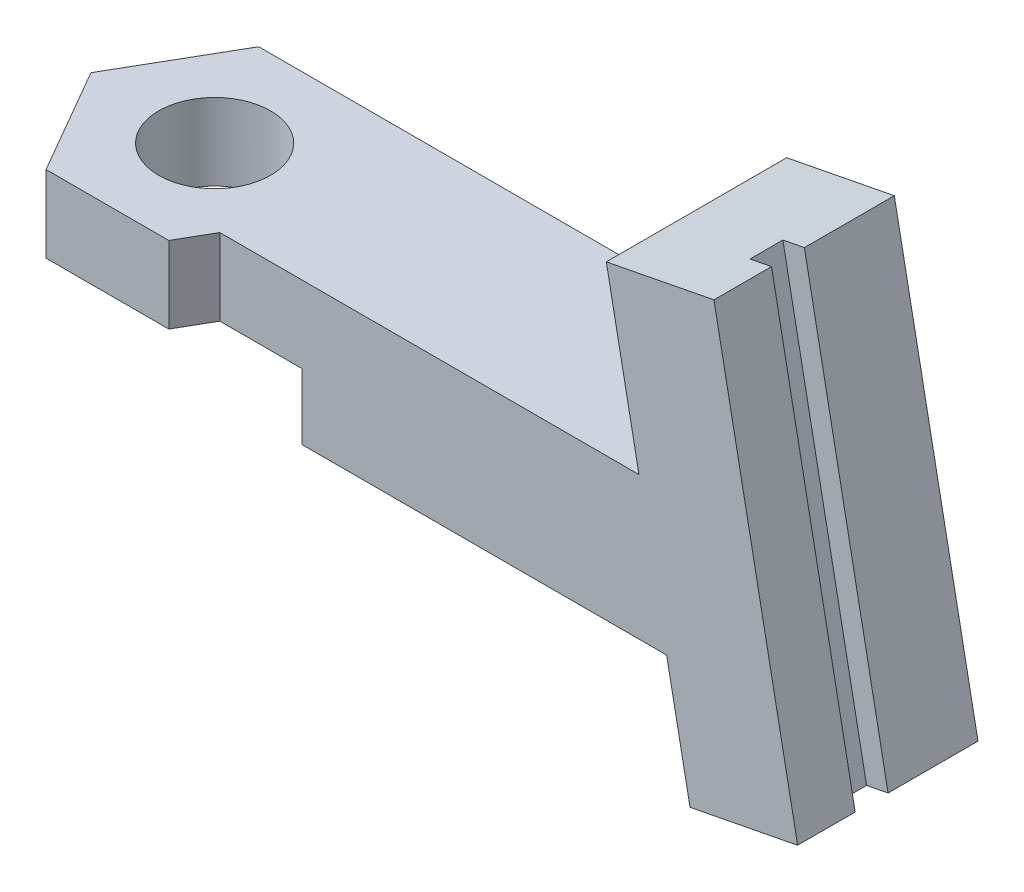
ISO-10303-21;
HEADER;
FILE_DESCRIPTION(('STEP AP214'),'2;1');
FILE_NAME('part.step','',(''),(''),'','','');
FILE_SCHEMA(('AUTOMOTIVE_DESIGN { 1 0 10303 214 1 1 1 1 }'));
ENDSEC;
DATA;
#1=APPLICATION_CONTEXT('core data for automotive mechanical design processes');
#2=APPLICATION_PROTOCOL_DEFINITION('international standard','automotive_design',2000,#1);
#3=PRODUCT_CONTEXT('',#1,'mechanical');
#4=PRODUCT('Part','Part','',(#3));
#5=PRODUCT_RELATED_PRODUCT_CATEGORY('part','',(#4));
#6=PRODUCT_DEFINITION_FORMATION('','',#4);
#7=PRODUCT_DEFINITION_CONTEXT('part definition',#1,'design');
#8=PRODUCT_DEFINITION('design','',#6,#7);
#9=PRODUCT_DEFINITION_SHAPE('','',#8);
#10=(LENGTH_UNIT() NAMED_UNIT(*) SI_UNIT(.MILLI.,.METRE.));
#11=(NAMED_UNIT(*) PLANE_ANGLE_UNIT() SI_UNIT($,.RADIAN.));
#12=(NAMED_UNIT(*) SI_UNIT($,.STERADIAN.) SOLID_ANGLE_UNIT());
#13=UNCERTAINTY_MEASURE_WITH_UNIT(LENGTH_MEASURE(1.E-05),#10,'distance_accuracy_value','');
#14=(GEOMETRIC_REPRESENTATION_CONTEXT(3) GLOBAL_UNCERTAINTY_ASSIGNED_CONTEXT((#13)) GLOBAL_UNIT_ASSIGNED_CONTEXT((#10,
#11,#12)) REPRESENTATION_CONTEXT('',''));
#15=CARTESIAN_POINT('',(0.,0.,0.));
#16=DIRECTION('',(0.,0.,1.));
#17=DIRECTION('',(1.,0.,0.));
#18=AXIS2_PLACEMENT_3D('',#15,#16,#17);
#19=CARTESIAN_POINT('',(2.80014880556968,-14.8169947470239,8.225));
#20=DIRECTION('',(0.866025403784439,0.,0.5));
#21=DIRECTION('',(0.5,0.,-0.866025403784439));
#22=AXIS2_PLACEMENT_3D('',#19,#20,#21);
#23=PLANE('',#22);
#24=DIRECTION('',(0.,1.,0.));
#25=VECTOR('',#24,1.);
#26=CARTESIAN_POINT('',(2.80014880556968,-14.8169947470239,8.225));
#27=LINE('',#26,#25);
#28=CARTESIAN_POINT('',(2.80014880556968,3.,8.225));
#29=VERTEX_POINT('',#28);
#30=CARTESIAN_POINT('',(2.80014880556968,6.5,8.225));
#31=VERTEX_POINT('',#30);
#32=EDGE_CURVE('E244',#29,#31,#27,.T.);
#33=ORIENTED_EDGE('',*,*,#32,.F.);
#34=DIRECTION('',(0.5,0.,-0.866025403784439));
#35=VECTOR('',#34,1.);
#36=CARTESIAN_POINT('',(2.80014880556968,3.,8.225));
#37=LINE('',#36,#35);
#38=CARTESIAN_POINT('',(3.65174045262438,3.,6.75));
#39=VERTEX_POINT('',#38);
#40=EDGE_CURVE('E198',#29,#39,#37,.T.);
#41=ORIENTED_EDGE('',*,*,#40,.T.);
#42=DIRECTION('',(0.,-1.,0.));
#43=VECTOR('',#42,1.);
#44=CARTESIAN_POINT('',(3.65174045262438,6.5,6.75));
#45=LINE('',#44,#43);
#46=CARTESIAN_POINT('',(3.65174045262438,6.5,6.75));
#47=VERTEX_POINT('',#46);
#48=EDGE_CURVE('E226',#47,#39,#45,.T.);
#49=ORIENTED_EDGE('',*,*,#48,.F.);
#50=DIRECTION('',(0.5,0.,-0.866025403784439));
#51=VECTOR('',#50,1.);
#52=CARTESIAN_POINT('',(2.80014880556968,6.5,8.225));
#53=LINE('',#52,#51);
#54=EDGE_CURVE('E236',#31,#47,#53,.T.);
#55=ORIENTED_EDGE('',*,*,#54,.F.);
#56=EDGE_LOOP('',(#33,#41,#49,#55));
#57=FACE_BOUND('',#56,.T.);
#58=ADVANCED_FACE('F39',(#57),#23,.T.);
#59=CARTESIAN_POINT('',(-2.80014880556969,-14.8169947470239,-1.475));
#60=DIRECTION('',(-0.866025403784439,0.,-0.5));
#61=DIRECTION('',(-0.5,0.,0.866025403784439));
#62=AXIS2_PLACEMENT_3D('',#59,#60,#61);
#63=PLANE('',#62);
#64=DIRECTION('',(0.,1.,0.));
#65=VECTOR('',#64,1.);
#66=CARTESIAN_POINT('',(-2.80014880556969,-14.8169947470239,-1.475));
#67=LINE('',#66,#65);
#68=CARTESIAN_POINT('',(-2.80014880556969,3.,-1.475));
#69=VERTEX_POINT('',#68);
#70=CARTESIAN_POINT('',(-2.80014880556969,6.5,-1.475));
#71=VERTEX_POINT('',#70);
#72=EDGE_CURVE('E227',#69,#71,#67,.T.);
#73=ORIENTED_EDGE('',*,*,#72,.F.);
#74=DIRECTION('',(-0.5,0.,0.866025403784439));
#75=VECTOR('',#74,1.);
#76=CARTESIAN_POINT('',(-2.80014880556969,3.,-1.475));
#77=LINE('',#76,#75);
#78=CARTESIAN_POINT('',(-5.60029761113937,3.,3.375));
#79=VERTEX_POINT('',#78);
#80=EDGE_CURVE('E195',#69,#79,#77,.T.);
#81=ORIENTED_EDGE('',*,*,#80,.T.);
#82=DIRECTION('',(0.,1.,0.));
#83=VECTOR('',#82,1.);
#84=CARTESIAN_POINT('',(-5.60029761113937,-14.8169947470239,3.375));
#85=LINE('',#84,#83);
#86=CARTESIAN_POINT('',(-5.60029761113937,6.5,3.375));
#87=VERTEX_POINT('',#86);
#88=EDGE_CURVE('E242',#79,#87,#85,.T.);
#89=ORIENTED_EDGE('',*,*,#88,.T.);
#90=DIRECTION('',(-0.5,0.,0.866025403784439));
#91=VECTOR('',#90,1.);
#92=CARTESIAN_POINT('',(-2.80014880556969,6.5,-1.475));
#93=LINE('',#92,#91);
#94=EDGE_CURVE('E223',#71,#87,#93,.T.);
#95=ORIENTED_EDGE('',*,*,#94,.F.);
#96=EDGE_LOOP('',(#73,#81,#89,#95));
#97=FACE_BOUND('',#96,.T.);
#98=ADVANCED_FACE('F330',(#97),#63,.T.);
#99=CARTESIAN_POINT('',(-2.80014880556968,-14.8169947470239,8.225));
#100=DIRECTION('',(0.,0.,1.));
#101=DIRECTION('',(1.,0.,0.));
#102=AXIS2_PLACEMENT_3D('',#99,#100,#101);
#103=PLANE('',#102);
#104=DIRECTION('',(0.,1.,0.));
#105=VECTOR('',#104,1.);
#106=CARTESIAN_POINT('',(-2.80014880556968,-14.8169947470239,8.225));
#107=LINE('',#106,#105);
#108=CARTESIAN_POINT('',(-2.80014880556968,3.,8.225));
#109=VERTEX_POINT('',#108);
#110=CARTESIAN_POINT('',(-2.80014880556968,6.5,8.225));
#111=VERTEX_POINT('',#110);
#112=EDGE_CURVE('E246',#109,#111,#107,.T.);
#113=ORIENTED_EDGE('',*,*,#112,.F.);
#114=DIRECTION('',(1.,0.,0.));
#115=VECTOR('',#114,1.);
#116=CARTESIAN_POINT('',(-2.80014880556968,3.,8.225));
#117=LINE('',#116,#115);
#118=EDGE_CURVE('E54',#109,#29,#117,.T.);
#119=ORIENTED_EDGE('',*,*,#118,.T.);
#120=ORIENTED_EDGE('',*,*,#32,.T.);
#121=DIRECTION('',(1.,0.,0.));
#122=VECTOR('',#121,1.);
#123=CARTESIAN_POINT('',(-2.80014880556968,6.5,8.225));
#124=LINE('',#123,#122);
#125=EDGE_CURVE('E233',#111,#31,#124,.T.);
#126=ORIENTED_EDGE('',*,*,#125,.F.);
#127=EDGE_LOOP('',(#113,#119,#120,#126));
#128=FACE_BOUND('',#127,.T.);
#129=ADVANCED_FACE('F324',(#128),#103,.T.);
#130=CARTESIAN_POINT('',(-5.60029761113937,-14.8169947470239,3.375));
#131=DIRECTION('',(-0.866025403784439,0.,0.5));
#132=DIRECTION('',(0.5,0.,0.866025403784439));
#133=AXIS2_PLACEMENT_3D('',#130,#131,#132);
#134=PLANE('',#133);
#135=ORIENTED_EDGE('',*,*,#88,.F.);
#136=DIRECTION('',(0.5,0.,0.866025403784439));
#137=VECTOR('',#136,1.);
#138=CARTESIAN_POINT('',(-5.60029761113937,3.,3.375));
#139=LINE('',#138,#137);
#140=EDGE_CURVE('E192',#79,#109,#139,.T.);
#141=ORIENTED_EDGE('',*,*,#140,.T.);
#142=ORIENTED_EDGE('',*,*,#112,.T.);
#143=DIRECTION('',(0.5,0.,0.866025403784439));
#144=VECTOR('',#143,1.);
#145=CARTESIAN_POINT('',(-5.60029761113937,6.5,3.375));
#146=LINE('',#145,#144);
#147=EDGE_CURVE('E230',#87,#111,#146,.T.);
#148=ORIENTED_EDGE('',*,*,#147,.F.);
#149=EDGE_LOOP('',(#135,#141,#142,#148));
#150=FACE_BOUND('',#149,.T.);
#151=ADVANCED_FACE('F314',(#150),#134,.T.);
#152=CARTESIAN_POINT('',(0.,-3.5,3.33561597332667));
#153=DIRECTION('',(0.,1.,0.));
#154=DIRECTION('',(0.,0.,1.));
#155=AXIS2_PLACEMENT_3D('',#152,#153,#154);
#156=CYLINDRICAL_SURFACE('',#155,2.55);
#157=CARTESIAN_POINT('',(0.,6.5,3.33561597332667));
#158=DIRECTION('',(0.,1.,0.));
#159=DIRECTION('',(0.,0.,1.));
#160=AXIS2_PLACEMENT_3D('',#157,#158,#159);
#161=CIRCLE('',#160,2.55);
#162=CARTESIAN_POINT('',(0.,6.5,5.88561597332667));
#163=VERTEX_POINT('',#162);
#164=EDGE_CURVE('E209',#163,#163,#161,.T.);
#165=ORIENTED_EDGE('',*,*,#164,.T.);
#166=EDGE_LOOP('',(#165));
#167=FACE_BOUND('',#166,.T.);
#168=CARTESIAN_POINT('',(0.,3.,3.33561597332667));
#169=DIRECTION('',(0.,-1.,0.));
#170=DIRECTION('',(0.,0.,-1.));
#171=AXIS2_PLACEMENT_3D('',#168,#169,#170);
#172=CIRCLE('',#171,2.55);
#173=CARTESIAN_POINT('',(0.,3.,0.78561597332667));
#174=VERTEX_POINT('',#173);
#175=EDGE_CURVE('E182',#174,#174,#172,.F.);
#176=ORIENTED_EDGE('',*,*,#175,.F.);
#177=EDGE_LOOP('',(#176));
#178=FACE_BOUND('',#177,.T.);
#179=ADVANCED_FACE('F311',(#167,#178),#156,.F.);
#180=CARTESIAN_POINT('',(21.2756841752307,14.1555211805119,-22.3589203380482));
#181=DIRECTION('',(-0.190808995376549,0.981627183447663,0.));
#182=DIRECTION('',(-0.981627183447663,-0.190808995376549,0.));
#183=AXIS2_PLACEMENT_3D('',#180,#181,#182);
#184=PLANE('',#183);
#185=DIRECTION('',(0.,0.,1.));
#186=VECTOR('',#185,1.);
#187=CARTESIAN_POINT('',(25.2021929090214,14.9187571620179,2.625));
#188=LINE('',#187,#186);
#189=CARTESIAN_POINT('',(25.2021929090214,14.9187571620179,2.625));
#190=VERTEX_POINT('',#189);
#191=CARTESIAN_POINT('',(25.2021929090214,14.9187571620179,4.125));
#192=VERTEX_POINT('',#191);
#193=EDGE_CURVE('E255',#190,#192,#188,.T.);
#194=ORIENTED_EDGE('',*,*,#193,.F.);
#195=DIRECTION('',(0.981627183447664,0.190808995376542,0.));
#196=VECTOR('',#195,1.);
#197=CARTESIAN_POINT('',(25.2021929090214,14.9187571620179,2.625));
#198=LINE('',#197,#196);
#199=CARTESIAN_POINT('',(26.183820092469,15.1095661573944,2.625));
#200=VERTEX_POINT('',#199);
#201=EDGE_CURVE('E250',#190,#200,#198,.T.);
#202=ORIENTED_EDGE('',*,*,#201,.T.);
#203=DIRECTION('',(0.,0.,1.));
#204=VECTOR('',#203,1.);
#205=CARTESIAN_POINT('',(26.183820092469,15.1095661573946,-22.3589203380482));
#206=LINE('',#205,#204);
#207=CARTESIAN_POINT('',(26.183820092469,15.1095661573946,-1.475));
#208=VERTEX_POINT('',#207);
#209=EDGE_CURVE('E285',#208,#200,#206,.T.);
#210=ORIENTED_EDGE('',*,*,#209,.F.);
#211=DIRECTION('',(0.981627183447663,0.190808995376549,0.));
#212=VECTOR('',#211,1.);
#213=CARTESIAN_POINT('',(26.183820092469,15.1095661573946,-1.475));
#214=LINE('',#213,#212);
#215=CARTESIAN_POINT('',(21.2756841752307,14.1555211805119,-1.475));
#216=VERTEX_POINT('',#215);
#217=EDGE_CURVE('E216',#216,#208,#214,.T.);
#218=ORIENTED_EDGE('',*,*,#217,.F.);
#219=DIRECTION('',(0.,0.,1.));
#220=VECTOR('',#219,1.);
#221=CARTESIAN_POINT('',(21.2756841752307,14.1555211805119,-22.3589203380482));
#222=LINE('',#221,#220);
#223=CARTESIAN_POINT('',(21.2756841752307,14.1555211805119,6.75));
#224=VERTEX_POINT('',#223);
#225=EDGE_CURVE('E281',#216,#224,#222,.T.);
#226=ORIENTED_EDGE('',*,*,#225,.T.);
#227=DIRECTION('',(0.981627183447663,0.190808995376549,0.));
#228=VECTOR('',#227,1.);
#229=CARTESIAN_POINT('',(21.2756841752307,14.1555211805119,6.75));
#230=LINE('',#229,#228);
#231=CARTESIAN_POINT('',(26.183820092469,15.1095661573946,6.75000000000001));
#232=VERTEX_POINT('',#231);
#233=EDGE_CURVE('E267',#224,#232,#230,.T.);
#234=ORIENTED_EDGE('',*,*,#233,.T.);
#235=CARTESIAN_POINT('',(26.183820092469,15.1095661573944,4.125));
#236=VERTEX_POINT('',#235);
#237=EDGE_CURVE('E288',#236,#232,#206,.T.);
#238=ORIENTED_EDGE('',*,*,#237,.F.);
#239=DIRECTION('',(0.981627183447664,0.190808995376542,0.));
#240=VECTOR('',#239,1.);
#241=CARTESIAN_POINT('',(25.2021929090214,14.9187571620179,4.125));
#242=LINE('',#241,#240);
#243=EDGE_CURVE('E253',#192,#236,#242,.T.);
#244=ORIENTED_EDGE('',*,*,#243,.F.);
#245=EDGE_LOOP('',(#194,#202,#210,#218,#226,#234,#238,#244));
#246=FACE_BOUND('',#245,.T.);
#247=ADVANCED_FACE('F313',(#246),#184,.T.);
#248=CARTESIAN_POINT('',(26.183820092469,15.1095661573946,-22.3589203380482));
#249=DIRECTION('',(0.981627183447663,0.190808995376549,0.));
#250=DIRECTION('',(-0.190808995376549,0.981627183447663,0.));
#251=AXIS2_PLACEMENT_3D('',#248,#249,#250);
#252=PLANE('',#251);
#253=ORIENTED_EDGE('',*,*,#209,.T.);
#254=DIRECTION('',(-0.190808995376542,0.981627183447665,0.));
#255=VECTOR('',#254,1.);
#256=CARTESIAN_POINT('',(30.5724269861295,-7.46785906190183,2.625));
#257=LINE('',#256,#255);
#258=CARTESIAN_POINT('',(29.9999999999999,-4.52297751155865,2.625));
#259=VERTEX_POINT('',#258);
#260=EDGE_CURVE('E265',#259,#200,#257,.T.);
#261=ORIENTED_EDGE('',*,*,#260,.F.);
#262=DIRECTION('',(0.,0.,1.));
#263=VECTOR('',#262,1.);
#264=CARTESIAN_POINT('',(30.,-4.52297751155863,-22.3589203380482));
#265=LINE('',#264,#263);
#266=CARTESIAN_POINT('',(30.,-4.52297751155863,-1.475));
#267=VERTEX_POINT('',#266);
#268=EDGE_CURVE('E289',#267,#259,#265,.T.);
#269=ORIENTED_EDGE('',*,*,#268,.F.);
#270=DIRECTION('',(0.190808995376549,-0.981627183447663,0.));
#271=VECTOR('',#270,1.);
#272=CARTESIAN_POINT('',(30.,-4.52297751155863,-1.475));
#273=LINE('',#272,#271);
#274=EDGE_CURVE('E213',#208,#267,#273,.T.);
#275=ORIENTED_EDGE('',*,*,#274,.F.);
#276=EDGE_LOOP('',(#253,#261,#269,#275));
#277=FACE_BOUND('',#276,.T.);
#278=ADVANCED_FACE('F321',(#277),#252,.T.);
#279=CARTESIAN_POINT('',(30.,-4.52297751155863,-22.3589203380482));
#280=DIRECTION('',(0.190808995376549,-0.981627183447663,0.));
#281=DIRECTION('',(0.981627183447663,0.190808995376549,0.));
#282=AXIS2_PLACEMENT_3D('',#279,#280,#281);
#283=PLANE('',#282);
#284=ORIENTED_EDGE('',*,*,#268,.T.);
#285=DIRECTION('',(-0.981627183447663,-0.190808995376549,0.));
#286=VECTOR('',#285,1.);
#287=CARTESIAN_POINT('',(30.,-4.52297751155863,2.625));
#288=LINE('',#287,#286);
#289=CARTESIAN_POINT('',(29.0183728165522,-4.7137865069352,2.625));
#290=VERTEX_POINT('',#289);
#291=EDGE_CURVE('E47',#259,#290,#288,.T.);
#292=ORIENTED_EDGE('',*,*,#291,.T.);
#293=DIRECTION('',(0.,0.,-1.));
#294=VECTOR('',#293,1.);
#295=CARTESIAN_POINT('',(29.0183728165522,-4.7137865069352,-22.3589203380482));
#296=LINE('',#295,#294);
#297=CARTESIAN_POINT('',(29.0183728165522,-4.7137865069352,4.125));
#298=VERTEX_POINT('',#297);
#299=EDGE_CURVE('E302',#298,#290,#296,.T.);
#300=ORIENTED_EDGE('',*,*,#299,.F.);
#301=DIRECTION('',(-0.981627183447663,-0.190808995376549,0.));
#302=VECTOR('',#301,1.);
#303=CARTESIAN_POINT('',(30.,-4.52297751155862,4.125));
#304=LINE('',#303,#302);
#305=CARTESIAN_POINT('',(29.9999999999999,-4.52297751155865,4.125));
#306=VERTEX_POINT('',#305);
#307=EDGE_CURVE('E304',#306,#298,#304,.T.);
#308=ORIENTED_EDGE('',*,*,#307,.F.);
#309=CARTESIAN_POINT('',(30.,-4.52297751155863,6.75));
#310=VERTEX_POINT('',#309);
#311=EDGE_CURVE('E292',#306,#310,#265,.T.);
#312=ORIENTED_EDGE('',*,*,#311,.T.);
#313=DIRECTION('',(-0.981627183447663,-0.190808995376549,0.));
#314=VECTOR('',#313,1.);
#315=CARTESIAN_POINT('',(30.,-4.52297751155863,6.75));
#316=LINE('',#315,#314);
#317=CARTESIAN_POINT('',(25.0918640827617,-5.47702248844137,6.75));
#318=VERTEX_POINT('',#317);
#319=EDGE_CURVE('E271',#310,#318,#316,.T.);
#320=ORIENTED_EDGE('',*,*,#319,.T.);
#321=DIRECTION('',(0.,0.,1.));
#322=VECTOR('',#321,1.);
#323=CARTESIAN_POINT('',(25.0918640827617,-5.47702248844137,-22.3589203380482));
#324=LINE('',#323,#322);
#325=CARTESIAN_POINT('',(25.0918640827617,-5.47702248844137,-1.475));
#326=VERTEX_POINT('',#325);
#327=EDGE_CURVE('E278',#326,#318,#324,.T.);
#328=ORIENTED_EDGE('',*,*,#327,.F.);
#329=DIRECTION('',(-0.981627183447663,-0.190808995376549,0.));
#330=VECTOR('',#329,1.);
#331=CARTESIAN_POINT('',(25.0918640827617,-5.47702248844137,-1.475));
#332=LINE('',#331,#330);
#333=EDGE_CURVE('E210',#267,#326,#332,.T.);
#334=ORIENTED_EDGE('',*,*,#333,.F.);
#335=EDGE_LOOP('',(#284,#292,#300,#308,#312,#320,#328,#334));
#336=FACE_BOUND('',#335,.T.);
#337=ADVANCED_FACE('F361',(#336),#283,.T.);
#338=CARTESIAN_POINT('',(0.,6.5,6.75));
#339=DIRECTION('',(0.,0.,-1.));
#340=DIRECTION('',(-1.,0.,0.));
#341=AXIS2_PLACEMENT_3D('',#338,#339,#340);
#342=PLANE('',#341);
#343=DIRECTION('',(-1.,0.,0.));
#344=VECTOR('',#343,1.);
#345=CARTESIAN_POINT('',(0.,3.,6.75));
#346=LINE('',#345,#344);
#347=CARTESIAN_POINT('',(7.40451720235695,3.,6.75));
#348=VERTEX_POINT('',#347);
#349=EDGE_CURVE('E201',#348,#39,#346,.T.);
#350=ORIENTED_EDGE('',*,*,#349,.F.);
#351=DIRECTION('',(0.,-1.,0.));
#352=VECTOR('',#351,1.);
#353=CARTESIAN_POINT('',(7.40451720235695,6.5,6.75));
#354=LINE('',#353,#352);
#355=CARTESIAN_POINT('',(7.40451720235695,0.,6.75));
#356=VERTEX_POINT('',#355);
#357=EDGE_CURVE('E186',#348,#356,#354,.T.);
#358=ORIENTED_EDGE('',*,*,#357,.T.);
#359=DIRECTION('',(1.,0.,0.));
#360=VECTOR('',#359,1.);
#361=CARTESIAN_POINT('',(0.,0.,6.75));
#362=LINE('',#361,#360);
#363=CARTESIAN_POINT('',(24.0272387583042,0.,6.75));
#364=VERTEX_POINT('',#363);
#365=EDGE_CURVE('E296',#356,#364,#362,.T.);
#366=ORIENTED_EDGE('',*,*,#365,.T.);
#367=DIRECTION('',(-0.190808995376549,0.981627183447663,0.));
#368=VECTOR('',#367,1.);
#369=CARTESIAN_POINT('',(25.0918640827617,-5.47702248844137,6.75));
#370=LINE('',#369,#368);
#371=EDGE_CURVE('E275',#318,#364,#370,.T.);
#372=ORIENTED_EDGE('',*,*,#371,.F.);
#373=ORIENTED_EDGE('',*,*,#319,.F.);
#374=DIRECTION('',(0.190808995376549,-0.981627183447663,0.));
#375=VECTOR('',#374,1.);
#376=CARTESIAN_POINT('',(26.183820092469,15.1095661573946,6.75));
#377=LINE('',#376,#375);
#378=EDGE_CURVE('E268',#232,#310,#377,.T.);
#379=ORIENTED_EDGE('',*,*,#378,.F.);
#380=ORIENTED_EDGE('',*,*,#233,.F.);
#381=CARTESIAN_POINT('',(22.763766748909,6.5,6.75));
#382=VERTEX_POINT('',#381);
#383=EDGE_CURVE('E274',#382,#224,#370,.T.);
#384=ORIENTED_EDGE('',*,*,#383,.F.);
#385=DIRECTION('',(1.,0.,0.));
#386=VECTOR('',#385,1.);
#387=CARTESIAN_POINT('',(0.,6.5,6.75));
#388=LINE('',#387,#386);
#389=EDGE_CURVE('E62',#47,#382,#388,.T.);
#390=ORIENTED_EDGE('',*,*,#389,.F.);
#391=ORIENTED_EDGE('',*,*,#48,.T.);
#392=EDGE_LOOP('',(#350,#358,#366,#372,#373,#379,#380,#384,#390,#391));
#393=FACE_BOUND('',#392,.T.);
#394=ADVANCED_FACE('F41',(#393),#342,.F.);
#395=CARTESIAN_POINT('',(0.,6.5,0.));
#396=DIRECTION('',(0.,1.,0.));
#397=DIRECTION('',(0.,0.,1.));
#398=AXIS2_PLACEMENT_3D('',#395,#396,#397);
#399=PLANE('',#398);
#400=DIRECTION('',(0.,0.,1.));
#401=VECTOR('',#400,1.);
#402=CARTESIAN_POINT('',(22.763766748909,6.5,0.));
#403=LINE('',#402,#401);
#404=CARTESIAN_POINT('',(22.763766748909,6.5,-1.475));
#405=VERTEX_POINT('',#404);
#406=EDGE_CURVE('E284',#405,#382,#403,.T.);
#407=ORIENTED_EDGE('',*,*,#406,.F.);
#408=DIRECTION('',(-1.,0.,0.));
#409=VECTOR('',#408,1.);
#410=CARTESIAN_POINT('',(2.80014880556968,6.5,-1.475));
#411=LINE('',#410,#409);
#412=EDGE_CURVE('E239',#405,#71,#411,.T.);
#413=ORIENTED_EDGE('',*,*,#412,.T.);
#414=ORIENTED_EDGE('',*,*,#94,.T.);
#415=ORIENTED_EDGE('',*,*,#147,.T.);
#416=ORIENTED_EDGE('',*,*,#125,.T.);
#417=ORIENTED_EDGE('',*,*,#54,.T.);
#418=ORIENTED_EDGE('',*,*,#389,.T.);
#419=EDGE_LOOP('',(#407,#413,#414,#415,#416,#417,#418));
#420=FACE_BOUND('',#419,.T.);
#421=ORIENTED_EDGE('',*,*,#164,.F.);
#422=EDGE_LOOP('',(#421));
#423=FACE_BOUND('',#422,.T.);
#424=ADVANCED_FACE('F369',(#420,#423),#399,.T.);
#425=CARTESIAN_POINT('',(0.,0.,0.));
#426=DIRECTION('',(0.,1.,0.));
#427=DIRECTION('',(0.,0.,1.));
#428=AXIS2_PLACEMENT_3D('',#425,#426,#427);
#429=PLANE('',#428);
#430=ORIENTED_EDGE('',*,*,#365,.F.);
#431=DIRECTION('',(-0.5,0.,0.866025403784439));
#432=VECTOR('',#431,1.);
#433=CARTESIAN_POINT('',(9.35307436087194,0.,3.375));
#434=LINE('',#433,#432);
#435=CARTESIAN_POINT('',(9.35307436087194,0.,3.375));
#436=VERTEX_POINT('',#435);
#437=EDGE_CURVE('E188',#436,#356,#434,.T.);
#438=ORIENTED_EDGE('',*,*,#437,.F.);
#439=DIRECTION('',(0.5,0.,0.866025403784439));
#440=VECTOR('',#439,1.);
#441=CARTESIAN_POINT('',(4.67653718043597,0.,-4.725));
#442=LINE('',#441,#440);
#443=CARTESIAN_POINT('',(6.55292555530225,0.,-1.475));
#444=VERTEX_POINT('',#443);
#445=EDGE_CURVE('E179',#444,#436,#442,.T.);
#446=ORIENTED_EDGE('',*,*,#445,.F.);
#447=DIRECTION('',(1.,0.,0.));
#448=VECTOR('',#447,1.);
#449=CARTESIAN_POINT('',(2.80014880556968,0.,-1.475));
#450=LINE('',#449,#448);
#451=CARTESIAN_POINT('',(24.0272387583042,0.,-1.475));
#452=VERTEX_POINT('',#451);
#453=EDGE_CURVE('E224',#444,#452,#450,.T.);
#454=ORIENTED_EDGE('',*,*,#453,.T.);
#455=DIRECTION('',(0.,0.,1.));
#456=VECTOR('',#455,1.);
#457=CARTESIAN_POINT('',(24.0272387583042,0.,0.));
#458=LINE('',#457,#456);
#459=EDGE_CURVE('E298',#452,#364,#458,.T.);
#460=ORIENTED_EDGE('',*,*,#459,.T.);
#461=EDGE_LOOP('',(#430,#438,#446,#454,#460));
#462=FACE_BOUND('',#461,.T.);
#463=ADVANCED_FACE('F371',(#462),#429,.F.);
#464=CARTESIAN_POINT('',(25.0918640827617,-5.47702248844137,-22.3589203380482));
#465=DIRECTION('',(-0.981627183447663,-0.190808995376549,0.));
#466=DIRECTION('',(0.190808995376549,-0.981627183447663,0.));
#467=AXIS2_PLACEMENT_3D('',#464,#465,#466);
#468=PLANE('',#467);
#469=ORIENTED_EDGE('',*,*,#459,.F.);
#470=DIRECTION('',(-0.190808995376549,0.981627183447663,0.));
#471=VECTOR('',#470,1.);
#472=CARTESIAN_POINT('',(24.0272387583042,0.,-1.475));
#473=LINE('',#472,#471);
#474=EDGE_CURVE('E206',#326,#452,#473,.T.);
#475=ORIENTED_EDGE('',*,*,#474,.F.);
#476=ORIENTED_EDGE('',*,*,#327,.T.);
#477=ORIENTED_EDGE('',*,*,#371,.T.);
#478=EDGE_LOOP('',(#469,#475,#476,#477));
#479=FACE_BOUND('',#478,.T.);
#480=ADVANCED_FACE('F367',(#479),#468,.T.);
#481=ORIENTED_EDGE('',*,*,#225,.F.);
#482=DIRECTION('',(-0.190808995376549,0.981627183447663,0.));
#483=VECTOR('',#482,1.);
#484=CARTESIAN_POINT('',(21.2756841752307,14.1555211805119,-1.475));
#485=LINE('',#484,#483);
#486=EDGE_CURVE('E205',#405,#216,#485,.T.);
#487=ORIENTED_EDGE('',*,*,#486,.F.);
#488=ORIENTED_EDGE('',*,*,#406,.T.);
#489=ORIENTED_EDGE('',*,*,#383,.T.);
#490=EDGE_LOOP('',(#481,#487,#488,#489));
#491=FACE_BOUND('',#490,.T.);
#492=ADVANCED_FACE('F359',(#491),#468,.T.);
#493=DIRECTION('',(-0.190808995376542,0.981627183447665,0.));
#494=VECTOR('',#493,1.);
#495=CARTESIAN_POINT('',(30.5724269861295,-7.46785906190183,4.125));
#496=LINE('',#495,#494);
#497=EDGE_CURVE('E262',#306,#236,#496,.T.);
#498=ORIENTED_EDGE('',*,*,#497,.T.);
#499=ORIENTED_EDGE('',*,*,#237,.T.);
#500=ORIENTED_EDGE('',*,*,#378,.T.);
#501=ORIENTED_EDGE('',*,*,#311,.F.);
#502=EDGE_LOOP('',(#498,#499,#500,#501));
#503=FACE_BOUND('',#502,.T.);
#504=ADVANCED_FACE('F354',(#503),#252,.T.);
#505=CARTESIAN_POINT('',(29.5907998026819,-7.65866805727838,2.625));
#506=DIRECTION('',(0.,0.,1.));
#507=DIRECTION('',(1.,0.,0.));
#508=AXIS2_PLACEMENT_3D('',#505,#506,#507);
#509=PLANE('',#508);
#510=ORIENTED_EDGE('',*,*,#260,.T.);
#511=ORIENTED_EDGE('',*,*,#201,.F.);
#512=DIRECTION('',(-0.190808995376542,0.981627183447665,0.));
#513=VECTOR('',#512,1.);
#514=CARTESIAN_POINT('',(29.5907998026819,-7.65866805727838,2.625));
#515=LINE('',#514,#513);
#516=EDGE_CURVE('E258',#290,#190,#515,.T.);
#517=ORIENTED_EDGE('',*,*,#516,.F.);
#518=ORIENTED_EDGE('',*,*,#291,.F.);
#519=EDGE_LOOP('',(#510,#511,#517,#518));
#520=FACE_BOUND('',#519,.T.);
#521=ADVANCED_FACE('F351',(#520),#509,.T.);
#522=CARTESIAN_POINT('',(29.5907998026819,-7.65866805727838,4.125));
#523=DIRECTION('',(0.,0.,1.));
#524=DIRECTION('',(1.,0.,0.));
#525=AXIS2_PLACEMENT_3D('',#522,#523,#524);
#526=PLANE('',#525);
#527=ORIENTED_EDGE('',*,*,#307,.T.);
#528=DIRECTION('',(-0.190808995376542,0.981627183447665,0.));
#529=VECTOR('',#528,1.);
#530=CARTESIAN_POINT('',(29.5907998026819,-7.65866805727838,4.125));
#531=LINE('',#530,#529);
#532=EDGE_CURVE('E260',#298,#192,#531,.T.);
#533=ORIENTED_EDGE('',*,*,#532,.T.);
#534=ORIENTED_EDGE('',*,*,#243,.T.);
#535=ORIENTED_EDGE('',*,*,#497,.F.);
#536=EDGE_LOOP('',(#527,#533,#534,#535));
#537=FACE_BOUND('',#536,.T.);
#538=ADVANCED_FACE('F347',(#537),#526,.F.);
#539=CARTESIAN_POINT('',(29.5907998026819,-7.65866805727838,2.625));
#540=DIRECTION('',(-0.981627183447665,-0.190808995376542,0.));
#541=DIRECTION('',(0.190808995376542,-0.981627183447665,0.));
#542=AXIS2_PLACEMENT_3D('',#539,#540,#541);
#543=PLANE('',#542);
#544=ORIENTED_EDGE('',*,*,#299,.T.);
#545=ORIENTED_EDGE('',*,*,#516,.T.);
#546=ORIENTED_EDGE('',*,*,#193,.T.);
#547=ORIENTED_EDGE('',*,*,#532,.F.);
#548=EDGE_LOOP('',(#544,#545,#546,#547));
#549=FACE_BOUND('',#548,.T.);
#550=ADVANCED_FACE('F344',(#549),#543,.F.);
#551=CARTESIAN_POINT('',(2.80014880556968,-14.8169947470239,-1.475));
#552=DIRECTION('',(0.,0.,-1.));
#553=DIRECTION('',(-1.,0.,0.));
#554=AXIS2_PLACEMENT_3D('',#551,#552,#553);
#555=PLANE('',#554);
#556=DIRECTION('',(0.,-1.,0.));
#557=VECTOR('',#556,1.);
#558=CARTESIAN_POINT('',(6.55292555530225,-14.8169947470239,-1.475));
#559=LINE('',#558,#557);
#560=CARTESIAN_POINT('',(6.55292555530225,3.,-1.475));
#561=VERTEX_POINT('',#560);
#562=EDGE_CURVE('E11',#561,#444,#559,.T.);
#563=ORIENTED_EDGE('',*,*,#562,.F.);
#564=DIRECTION('',(-1.,0.,0.));
#565=VECTOR('',#564,1.);
#566=CARTESIAN_POINT('',(2.80014880556968,3.,-1.475));
#567=LINE('',#566,#565);
#568=EDGE_CURVE('E171',#561,#69,#567,.T.);
#569=ORIENTED_EDGE('',*,*,#568,.T.);
#570=ORIENTED_EDGE('',*,*,#72,.T.);
#571=ORIENTED_EDGE('',*,*,#412,.F.);
#572=ORIENTED_EDGE('',*,*,#486,.T.);
#573=ORIENTED_EDGE('',*,*,#217,.T.);
#574=ORIENTED_EDGE('',*,*,#274,.T.);
#575=ORIENTED_EDGE('',*,*,#333,.T.);
#576=ORIENTED_EDGE('',*,*,#474,.T.);
#577=ORIENTED_EDGE('',*,*,#453,.F.);
#578=EDGE_LOOP('',(#563,#569,#570,#571,#572,#573,#574,#575,#576,#577));
#579=FACE_BOUND('',#578,.T.);
#580=ADVANCED_FACE('F340',(#579),#555,.T.);
#581=CARTESIAN_POINT('',(9.35307436087194,3.,3.375));
#582=DIRECTION('',(0.866025403784438,0.,0.5));
#583=DIRECTION('',(0.5,0.,-0.866025403784439));
#584=AXIS2_PLACEMENT_3D('',#581,#582,#583);
#585=PLANE('',#584);
#586=DIRECTION('',(-0.5,0.,0.866025403784439));
#587=VECTOR('',#586,1.);
#588=CARTESIAN_POINT('',(9.35307436087194,3.,3.375));
#589=LINE('',#588,#587);
#590=CARTESIAN_POINT('',(9.35307436087194,3.,3.375));
#591=VERTEX_POINT('',#590);
#592=EDGE_CURVE('E168',#591,#348,#589,.T.);
#593=ORIENTED_EDGE('',*,*,#592,.F.);
#594=DIRECTION('',(0.,-1.,0.));
#595=VECTOR('',#594,1.);
#596=CARTESIAN_POINT('',(9.35307436087194,3.,3.375));
#597=LINE('',#596,#595);
#598=EDGE_CURVE('E174',#591,#436,#597,.T.);
#599=ORIENTED_EDGE('',*,*,#598,.T.);
#600=ORIENTED_EDGE('',*,*,#437,.T.);
#601=ORIENTED_EDGE('',*,*,#357,.F.);
#602=EDGE_LOOP('',(#593,#599,#600,#601));
#603=FACE_BOUND('',#602,.T.);
#604=ADVANCED_FACE('F184',(#603),#585,.F.);
#605=CARTESIAN_POINT('',(0.,3.,0.));
#606=DIRECTION('',(0.,-1.,0.));
#607=DIRECTION('',(0.,0.,-1.));
#608=AXIS2_PLACEMENT_3D('',#605,#606,#607);
#609=PLANE('',#608);
#610=DIRECTION('',(0.5,0.,0.866025403784439));
#611=VECTOR('',#610,1.);
#612=CARTESIAN_POINT('',(4.67653718043597,3.,-4.725));
#613=LINE('',#612,#611);
#614=EDGE_CURVE('E163',#561,#591,#613,.T.);
#615=ORIENTED_EDGE('',*,*,#614,.T.);
#616=ORIENTED_EDGE('',*,*,#592,.T.);
#617=ORIENTED_EDGE('',*,*,#349,.T.);
#618=ORIENTED_EDGE('',*,*,#40,.F.);
#619=ORIENTED_EDGE('',*,*,#118,.F.);
#620=ORIENTED_EDGE('',*,*,#140,.F.);
#621=ORIENTED_EDGE('',*,*,#80,.F.);
#622=ORIENTED_EDGE('',*,*,#568,.F.);
#623=EDGE_LOOP('',(#615,#616,#617,#618,#619,#620,#621,#622));
#624=FACE_BOUND('',#623,.T.);
#625=ORIENTED_EDGE('',*,*,#175,.T.);
#626=EDGE_LOOP('',(#625));
#627=FACE_BOUND('',#626,.T.);
#628=ADVANCED_FACE('F165',(#624,#627),#609,.T.);
#629=CARTESIAN_POINT('',(4.67653718043597,3.,-4.725));
#630=DIRECTION('',(0.866025403784439,0.,-0.5));
#631=DIRECTION('',(-0.5,0.,-0.866025403784439));
#632=AXIS2_PLACEMENT_3D('',#629,#630,#631);
#633=PLANE('',#632);
#634=ORIENTED_EDGE('',*,*,#562,.T.);
#635=ORIENTED_EDGE('',*,*,#445,.T.);
#636=ORIENTED_EDGE('',*,*,#598,.F.);
#637=ORIENTED_EDGE('',*,*,#614,.F.);
#638=EDGE_LOOP('',(#634,#635,#636,#637));
#639=FACE_BOUND('',#638,.T.);
#640=ADVANCED_FACE('F177',(#639),#633,.F.);
#641=CLOSED_SHELL('',(#58,#98,#129,#151,#179,#247,#278,#337,#394,#424,#463,#480,#492,#504,#521,
#538,#550,#580,#604,#628,#640));
#642=MANIFOLD_SOLID_BREP('B2',#641);
#643=ADVANCED_BREP_SHAPE_REPRESENTATION('',(#18,#642),#14);
#644=SHAPE_DEFINITION_REPRESENTATION(#9,#643);
ENDSEC;
END-ISO-10303-21;
